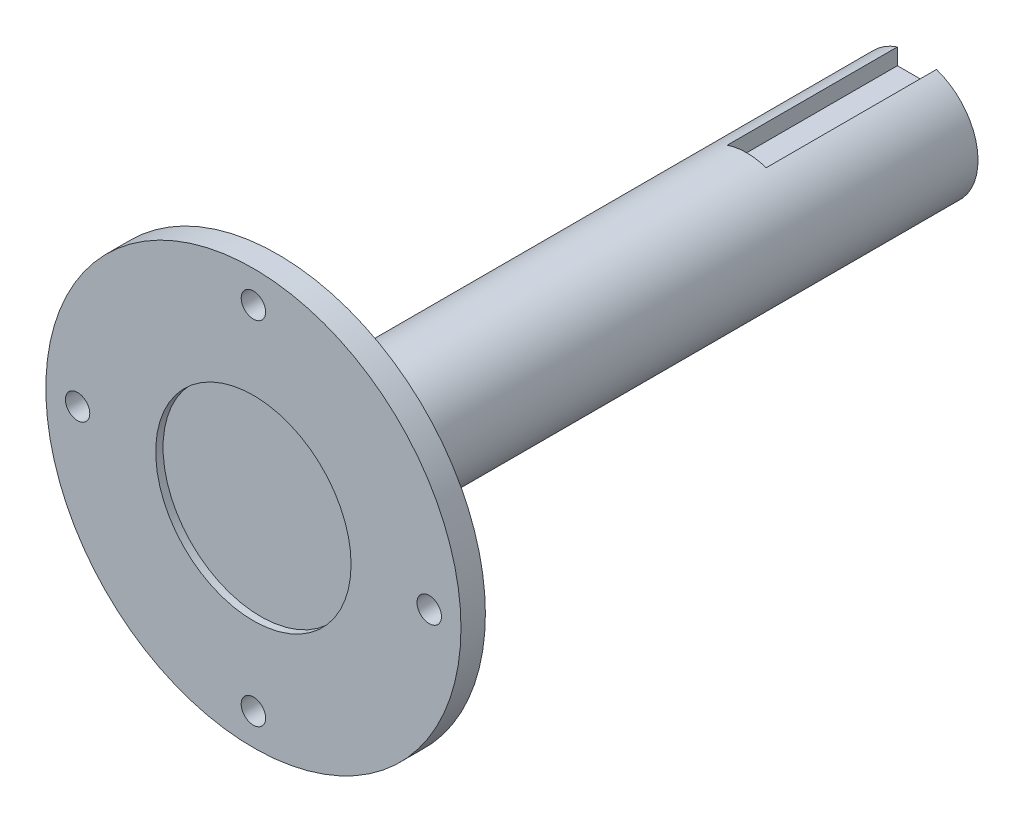
ISO-10303-21;
HEADER;
FILE_DESCRIPTION(('STEP AP214'),'2;1');
FILE_NAME('part.step','',(''),(''),'','','');
FILE_SCHEMA(('AUTOMOTIVE_DESIGN { 1 0 10303 214 1 1 1 1 }'));
ENDSEC;
DATA;
#1=APPLICATION_CONTEXT('core data for automotive mechanical design processes');
#2=APPLICATION_PROTOCOL_DEFINITION('international standard','automotive_design',2000,#1);
#3=PRODUCT_CONTEXT('',#1,'mechanical');
#4=PRODUCT('Part','Part','',(#3));
#5=PRODUCT_RELATED_PRODUCT_CATEGORY('part','',(#4));
#6=PRODUCT_DEFINITION_FORMATION('','',#4);
#7=PRODUCT_DEFINITION_CONTEXT('part definition',#1,'design');
#8=PRODUCT_DEFINITION('design','',#6,#7);
#9=PRODUCT_DEFINITION_SHAPE('','',#8);
#10=(LENGTH_UNIT() NAMED_UNIT(*) SI_UNIT(.MILLI.,.METRE.));
#11=(NAMED_UNIT(*) PLANE_ANGLE_UNIT() SI_UNIT($,.RADIAN.));
#12=(NAMED_UNIT(*) SI_UNIT($,.STERADIAN.) SOLID_ANGLE_UNIT());
#13=UNCERTAINTY_MEASURE_WITH_UNIT(LENGTH_MEASURE(1.E-05),#10,'distance_accuracy_value','');
#14=(GEOMETRIC_REPRESENTATION_CONTEXT(3) GLOBAL_UNCERTAINTY_ASSIGNED_CONTEXT((#13)) GLOBAL_UNIT_ASSIGNED_CONTEXT((#10,
#11,#12)) REPRESENTATION_CONTEXT('',''));
#15=CARTESIAN_POINT('',(0.,0.,0.));
#16=DIRECTION('',(0.,0.,1.));
#17=DIRECTION('',(1.,0.,0.));
#18=AXIS2_PLACEMENT_3D('',#15,#16,#17);
#19=CARTESIAN_POINT('',(0.,0.,119.4));
#20=DIRECTION('',(0.,0.,-1.));
#21=DIRECTION('',(-1.,0.,0.));
#22=AXIS2_PLACEMENT_3D('',#19,#20,#21);
#23=CYLINDRICAL_SURFACE('',#22,12.5);
#24=CARTESIAN_POINT('',(0.,0.,119.4));
#25=DIRECTION('',(0.,0.,1.));
#26=DIRECTION('',(1.,0.,0.));
#27=AXIS2_PLACEMENT_3D('',#24,#25,#26);
#28=CIRCLE('',#27,12.5);
#29=CARTESIAN_POINT('',(12.5,0.,119.4));
#30=VERTEX_POINT('',#29);
#31=EDGE_CURVE('E152',#30,#30,#28,.T.);
#32=ORIENTED_EDGE('',*,*,#31,.F.);
#33=EDGE_LOOP('',(#32));
#34=FACE_BOUND('',#33,.T.);
#35=CARTESIAN_POINT('',(0.,0.,0.53629326));
#36=DIRECTION('',(0.,0.,-1.));
#37=DIRECTION('',(-1.,0.,0.));
#38=AXIS2_PLACEMENT_3D('',#35,#36,#37);
#39=CIRCLE('',#38,12.5);
#40=CARTESIAN_POINT('',(4.,11.842719282327,0.53629326));
#41=VERTEX_POINT('',#40);
#42=CARTESIAN_POINT('',(-4.,11.842719282327,0.53629326));
#43=VERTEX_POINT('',#42);
#44=EDGE_CURVE('E100',#41,#43,#39,.T.);
#45=ORIENTED_EDGE('',*,*,#44,.F.);
#46=DIRECTION('',(0.,0.,-1.));
#47=VECTOR('',#46,1.);
#48=CARTESIAN_POINT('',(4.,11.842719282327,119.4));
#49=LINE('',#48,#47);
#50=CARTESIAN_POINT('',(4.,11.842719282327,35.4));
#51=VERTEX_POINT('',#50);
#52=EDGE_CURVE('E144',#41,#51,#49,.F.);
#53=ORIENTED_EDGE('',*,*,#52,.T.);
#54=CARTESIAN_POINT('',(0.,0.,35.4));
#55=DIRECTION('',(0.,0.,1.));
#56=DIRECTION('',(1.,0.,0.));
#57=AXIS2_PLACEMENT_3D('',#54,#55,#56);
#58=CIRCLE('',#57,12.5);
#59=CARTESIAN_POINT('',(-4.,11.842719282327,35.4));
#60=VERTEX_POINT('',#59);
#61=EDGE_CURVE('E121',#51,#60,#58,.T.);
#62=ORIENTED_EDGE('',*,*,#61,.T.);
#63=DIRECTION('',(0.,0.,-1.));
#64=VECTOR('',#63,1.);
#65=CARTESIAN_POINT('',(-4.,11.842719282327,119.4));
#66=LINE('',#65,#64);
#67=EDGE_CURVE('E68',#60,#43,#66,.T.);
#68=ORIENTED_EDGE('',*,*,#67,.T.);
#69=EDGE_LOOP('',(#45,#53,#62,#68));
#70=FACE_BOUND('',#69,.T.);
#71=ADVANCED_FACE('F45',(#34,#70),#23,.T.);
#72=CARTESIAN_POINT('',(-4.,8.5,35.4));
#73=DIRECTION('',(-1.,0.,0.));
#74=DIRECTION('',(0.,0.,1.));
#75=AXIS2_PLACEMENT_3D('',#72,#73,#74);
#76=PLANE('',#75);
#77=DIRECTION('',(0.,-1.,0.));
#78=VECTOR('',#77,1.);
#79=CARTESIAN_POINT('',(-4.,8.5,0.536293260000001));
#80=LINE('',#79,#78);
#81=CARTESIAN_POINT('',(-4.,8.5,0.536293260000001));
#82=VERTEX_POINT('',#81);
#83=EDGE_CURVE('E61',#43,#82,#80,.T.);
#84=ORIENTED_EDGE('',*,*,#83,.F.);
#85=ORIENTED_EDGE('',*,*,#67,.F.);
#86=DIRECTION('',(0.,1.,0.));
#87=VECTOR('',#86,1.);
#88=CARTESIAN_POINT('',(-4.,8.5,35.4));
#89=LINE('',#88,#87);
#90=CARTESIAN_POINT('',(-4.,8.5,35.4));
#91=VERTEX_POINT('',#90);
#92=EDGE_CURVE('E126',#91,#60,#89,.T.);
#93=ORIENTED_EDGE('',*,*,#92,.F.);
#94=DIRECTION('',(0.,0.,-1.));
#95=VECTOR('',#94,1.);
#96=CARTESIAN_POINT('',(-4.,8.5,35.4));
#97=LINE('',#96,#95);
#98=EDGE_CURVE('E140',#91,#82,#97,.T.);
#99=ORIENTED_EDGE('',*,*,#98,.T.);
#100=EDGE_LOOP('',(#84,#85,#93,#99));
#101=FACE_BOUND('',#100,.T.);
#102=ADVANCED_FACE('F173',(#101),#76,.F.);
#103=CARTESIAN_POINT('',(4.,8.5,35.4));
#104=DIRECTION('',(1.,0.,0.));
#105=DIRECTION('',(0.,0.,-1.));
#106=AXIS2_PLACEMENT_3D('',#103,#104,#105);
#107=PLANE('',#106);
#108=DIRECTION('',(0.,1.,0.));
#109=VECTOR('',#108,1.);
#110=CARTESIAN_POINT('',(4.,8.5,0.536293260000001));
#111=LINE('',#110,#109);
#112=CARTESIAN_POINT('',(4.,8.5,0.536293260000001));
#113=VERTEX_POINT('',#112);
#114=EDGE_CURVE('E105',#113,#41,#111,.T.);
#115=ORIENTED_EDGE('',*,*,#114,.F.);
#116=DIRECTION('',(0.,0.,-1.));
#117=VECTOR('',#116,1.);
#118=CARTESIAN_POINT('',(4.,8.5,35.4));
#119=LINE('',#118,#117);
#120=CARTESIAN_POINT('',(4.,8.5,35.4));
#121=VERTEX_POINT('',#120);
#122=EDGE_CURVE('E139',#121,#113,#119,.T.);
#123=ORIENTED_EDGE('',*,*,#122,.F.);
#124=DIRECTION('',(0.,-1.,0.));
#125=VECTOR('',#124,1.);
#126=CARTESIAN_POINT('',(4.,8.5,35.4));
#127=LINE('',#126,#125);
#128=EDGE_CURVE('E132',#51,#121,#127,.T.);
#129=ORIENTED_EDGE('',*,*,#128,.F.);
#130=ORIENTED_EDGE('',*,*,#52,.F.);
#131=EDGE_LOOP('',(#115,#123,#129,#130));
#132=FACE_BOUND('',#131,.T.);
#133=ADVANCED_FACE('F165',(#132),#107,.F.);
#134=CARTESIAN_POINT('',(4.,8.5,35.4));
#135=DIRECTION('',(0.,-1.,0.));
#136=DIRECTION('',(0.,0.,-1.));
#137=AXIS2_PLACEMENT_3D('',#134,#135,#136);
#138=PLANE('',#137);
#139=DIRECTION('',(1.,0.,0.));
#140=VECTOR('',#139,1.);
#141=CARTESIAN_POINT('',(4.,8.5,0.536293260000001));
#142=LINE('',#141,#140);
#143=EDGE_CURVE('E54',#82,#113,#142,.T.);
#144=ORIENTED_EDGE('',*,*,#143,.F.);
#145=ORIENTED_EDGE('',*,*,#98,.F.);
#146=DIRECTION('',(-1.,0.,0.));
#147=VECTOR('',#146,1.);
#148=CARTESIAN_POINT('',(4.,8.5,35.4));
#149=LINE('',#148,#147);
#150=EDGE_CURVE('E135',#121,#91,#149,.T.);
#151=ORIENTED_EDGE('',*,*,#150,.F.);
#152=ORIENTED_EDGE('',*,*,#122,.T.);
#153=EDGE_LOOP('',(#144,#145,#151,#152));
#154=FACE_BOUND('',#153,.T.);
#155=ADVANCED_FACE('F168',(#154),#138,.F.);
#156=CARTESIAN_POINT('',(0.,0.,35.4));
#157=DIRECTION('',(0.,0.,1.));
#158=DIRECTION('',(1.,0.,0.));
#159=AXIS2_PLACEMENT_3D('',#156,#157,#158);
#160=PLANE('',#159);
#161=ORIENTED_EDGE('',*,*,#128,.T.);
#162=ORIENTED_EDGE('',*,*,#150,.T.);
#163=ORIENTED_EDGE('',*,*,#92,.T.);
#164=ORIENTED_EDGE('',*,*,#61,.F.);
#165=EDGE_LOOP('',(#161,#162,#163,#164));
#166=FACE_BOUND('',#165,.T.);
#167=ADVANCED_FACE('F170',(#166),#160,.F.);
#168=CARTESIAN_POINT('',(0.,0.,121.4));
#169=DIRECTION('',(0.,0.,-1.));
#170=DIRECTION('',(-1.,0.,0.));
#171=AXIS2_PLACEMENT_3D('',#168,#169,#170);
#172=CYLINDRICAL_SURFACE('',#171,15.3);
#173=CARTESIAN_POINT('',(0.,0.,121.4));
#174=DIRECTION('',(0.,0.,1.));
#175=DIRECTION('',(1.,0.,0.));
#176=AXIS2_PLACEMENT_3D('',#173,#174,#175);
#177=CIRCLE('',#176,15.3);
#178=CARTESIAN_POINT('',(15.3,0.,121.4));
#179=VERTEX_POINT('',#178);
#180=EDGE_CURVE('E122',#179,#179,#177,.T.);
#181=ORIENTED_EDGE('',*,*,#180,.F.);
#182=EDGE_LOOP('',(#181));
#183=FACE_BOUND('',#182,.T.);
#184=CARTESIAN_POINT('',(0.,0.,119.4));
#185=DIRECTION('',(0.,0.,1.));
#186=DIRECTION('',(1.,0.,0.));
#187=AXIS2_PLACEMENT_3D('',#184,#185,#186);
#188=CIRCLE('',#187,15.3);
#189=CARTESIAN_POINT('',(15.3,0.,119.4));
#190=VERTEX_POINT('',#189);
#191=EDGE_CURVE('E116',#190,#190,#188,.T.);
#192=ORIENTED_EDGE('',*,*,#191,.T.);
#193=EDGE_LOOP('',(#192));
#194=FACE_BOUND('',#193,.T.);
#195=ADVANCED_FACE('F187',(#183,#194),#172,.T.);
#196=CARTESIAN_POINT('',(0.,0.,121.4));
#197=DIRECTION('',(0.,0.,1.));
#198=DIRECTION('',(1.,0.,0.));
#199=AXIS2_PLACEMENT_3D('',#196,#197,#198);
#200=PLANE('',#199);
#201=CARTESIAN_POINT('',(0.,0.,121.4));
#202=DIRECTION('',(0.,0.,1.));
#203=DIRECTION('',(1.,0.,0.));
#204=AXIS2_PLACEMENT_3D('',#201,#202,#203);
#205=CIRCLE('',#204,12.5);
#206=CARTESIAN_POINT('',(12.5,0.,121.4));
#207=VERTEX_POINT('',#206);
#208=EDGE_CURVE('E117',#207,#207,#205,.T.);
#209=ORIENTED_EDGE('',*,*,#208,.F.);
#210=EDGE_LOOP('',(#209));
#211=FACE_BOUND('',#210,.T.);
#212=ORIENTED_EDGE('',*,*,#180,.T.);
#213=EDGE_LOOP('',(#212));
#214=FACE_BOUND('',#213,.T.);
#215=ADVANCED_FACE('F190',(#211,#214),#200,.T.);
#216=CARTESIAN_POINT('',(0.,0.,119.4));
#217=DIRECTION('',(0.,0.,1.));
#218=DIRECTION('',(1.,0.,0.));
#219=AXIS2_PLACEMENT_3D('',#216,#217,#218);
#220=PLANE('',#219);
#221=ORIENTED_EDGE('',*,*,#31,.T.);
#222=EDGE_LOOP('',(#221));
#223=FACE_BOUND('',#222,.T.);
#224=ORIENTED_EDGE('',*,*,#191,.F.);
#225=EDGE_LOOP('',(#224));
#226=FACE_BOUND('',#225,.T.);
#227=ADVANCED_FACE('F192',(#223,#226),#220,.F.);
#228=CARTESIAN_POINT('',(0.,0.,0.53629326));
#229=DIRECTION('',(0.,0.,-1.));
#230=DIRECTION('',(-1.,0.,0.));
#231=AXIS2_PLACEMENT_3D('',#228,#229,#230);
#232=PLANE('',#231);
#233=CARTESIAN_POINT('',(0.,0.,0.536293259999999));
#234=DIRECTION('',(0.,0.,-1.));
#235=DIRECTION('',(-1.,0.,0.));
#236=AXIS2_PLACEMENT_3D('',#233,#234,#235);
#237=CIRCLE('',#236,2.49999999999999);
#238=CARTESIAN_POINT('',(-2.49999999999999,0.,0.536293259999999));
#239=VERTEX_POINT('',#238);
#240=EDGE_CURVE('E101',#239,#239,#237,.T.);
#241=ORIENTED_EDGE('',*,*,#240,.F.);
#242=EDGE_LOOP('',(#241));
#243=FACE_BOUND('',#242,.T.);
#244=ORIENTED_EDGE('',*,*,#83,.T.);
#245=ORIENTED_EDGE('',*,*,#143,.T.);
#246=ORIENTED_EDGE('',*,*,#114,.T.);
#247=ORIENTED_EDGE('',*,*,#44,.T.);
#248=EDGE_LOOP('',(#244,#245,#246,#247));
#249=FACE_BOUND('',#248,.T.);
#250=ADVANCED_FACE('F93',(#243,#249),#232,.T.);
#251=CARTESIAN_POINT('',(0.,0.,19.0341417124311));
#252=DIRECTION('',(0.,0.,-1.));
#253=DIRECTION('',(-1.,0.,0.));
#254=AXIS2_PLACEMENT_3D('',#251,#252,#253);
#255=CONICAL_SURFACE('',#254,2.5,1.02974425867665);
#256=CARTESIAN_POINT('',(0.,0.,20.53629326));
#257=VERTEX_POINT('',#256);
#258=VERTEX_LOOP('',#257);
#259=FACE_BOUND('',#258,.T.);
#260=CARTESIAN_POINT('',(0.,0.,19.0341417124311));
#261=DIRECTION('',(0.,0.,-1.));
#262=DIRECTION('',(-1.,0.,0.));
#263=AXIS2_PLACEMENT_3D('',#260,#261,#262);
#264=CIRCLE('',#263,2.5);
#265=CARTESIAN_POINT('',(-2.5,0.,19.0341417124311));
#266=VERTEX_POINT('',#265);
#267=EDGE_CURVE('E97',#266,#266,#264,.T.);
#268=ORIENTED_EDGE('',*,*,#267,.T.);
#269=EDGE_LOOP('',(#268));
#270=FACE_BOUND('',#269,.T.);
#271=ADVANCED_FACE('F89',(#259,#270),#255,.F.);
#272=CARTESIAN_POINT('',(0.,0.,0.53629326));
#273=DIRECTION('',(0.,0.,-1.));
#274=DIRECTION('',(-1.,0.,0.));
#275=AXIS2_PLACEMENT_3D('',#272,#273,#274);
#276=CYLINDRICAL_SURFACE('',#275,2.49999999999999);
#277=ORIENTED_EDGE('',*,*,#267,.F.);
#278=EDGE_LOOP('',(#277));
#279=FACE_BOUND('',#278,.T.);
#280=ORIENTED_EDGE('',*,*,#240,.T.);
#281=EDGE_LOOP('',(#280));
#282=FACE_BOUND('',#281,.T.);
#283=ADVANCED_FACE('F92',(#279,#282),#276,.F.);
#284=CARTESIAN_POINT('',(0.,0.,131.4));
#285=DIRECTION('',(0.,0.,1.));
#286=DIRECTION('',(1.,0.,0.));
#287=AXIS2_PLACEMENT_3D('',#284,#285,#286);
#288=CYLINDRICAL_SURFACE('',#287,42.5);
#289=CARTESIAN_POINT('',(0.,0.,131.4));
#290=DIRECTION('',(0.,0.,1.));
#291=DIRECTION('',(1.,0.,0.));
#292=AXIS2_PLACEMENT_3D('',#289,#290,#291);
#293=CIRCLE('',#292,42.5);
#294=CARTESIAN_POINT('',(42.5,0.,131.4));
#295=VERTEX_POINT('',#294);
#296=EDGE_CURVE('E108',#295,#295,#293,.T.);
#297=ORIENTED_EDGE('',*,*,#296,.T.);
#298=EDGE_LOOP('',(#297));
#299=FACE_BOUND('',#298,.T.);
#300=CARTESIAN_POINT('',(0.,0.,136.4));
#301=DIRECTION('',(0.,0.,1.));
#302=DIRECTION('',(1.,0.,0.));
#303=AXIS2_PLACEMENT_3D('',#300,#301,#302);
#304=CIRCLE('',#303,42.5);
#305=CARTESIAN_POINT('',(42.5,0.,136.4));
#306=VERTEX_POINT('',#305);
#307=EDGE_CURVE('E283',#306,#306,#304,.T.);
#308=ORIENTED_EDGE('',*,*,#307,.F.);
#309=EDGE_LOOP('',(#308));
#310=FACE_BOUND('',#309,.T.);
#311=ADVANCED_FACE('F209',(#299,#310),#288,.T.);
#312=CARTESIAN_POINT('',(0.,0.,131.4));
#313=DIRECTION('',(0.,0.,1.));
#314=DIRECTION('',(1.,0.,0.));
#315=AXIS2_PLACEMENT_3D('',#312,#313,#314);
#316=PLANE('',#315);
#317=CARTESIAN_POINT('',(0.,36.,131.4));
#318=DIRECTION('',(0.,0.,1.));
#319=DIRECTION('',(1.,0.,0.));
#320=AXIS2_PLACEMENT_3D('',#317,#318,#319);
#321=CIRCLE('',#320,2.49999999999999);
#322=CARTESIAN_POINT('',(2.49999999999999,36.,131.4));
#323=VERTEX_POINT('',#322);
#324=EDGE_CURVE('E251',#323,#323,#321,.T.);
#325=ORIENTED_EDGE('',*,*,#324,.T.);
#326=EDGE_LOOP('',(#325));
#327=FACE_BOUND('',#326,.T.);
#328=CARTESIAN_POINT('',(36.,0.,131.4));
#329=DIRECTION('',(0.,0.,1.));
#330=DIRECTION('',(1.,0.,0.));
#331=AXIS2_PLACEMENT_3D('',#328,#329,#330);
#332=CIRCLE('',#331,2.5);
#333=CARTESIAN_POINT('',(38.5,0.,131.4));
#334=VERTEX_POINT('',#333);
#335=EDGE_CURVE('E263',#334,#334,#332,.T.);
#336=ORIENTED_EDGE('',*,*,#335,.T.);
#337=EDGE_LOOP('',(#336));
#338=FACE_BOUND('',#337,.T.);
#339=CARTESIAN_POINT('',(0.,-36.,131.4));
#340=DIRECTION('',(0.,0.,1.));
#341=DIRECTION('',(1.,0.,0.));
#342=AXIS2_PLACEMENT_3D('',#339,#340,#341);
#343=CIRCLE('',#342,2.49999999999999);
#344=CARTESIAN_POINT('',(2.49999999999999,-36.,131.4));
#345=VERTEX_POINT('',#344);
#346=EDGE_CURVE('E271',#345,#345,#343,.T.);
#347=ORIENTED_EDGE('',*,*,#346,.T.);
#348=EDGE_LOOP('',(#347));
#349=FACE_BOUND('',#348,.T.);
#350=CARTESIAN_POINT('',(-36.,0.,131.4));
#351=DIRECTION('',(0.,0.,1.));
#352=DIRECTION('',(1.,0.,0.));
#353=AXIS2_PLACEMENT_3D('',#350,#351,#352);
#354=CIRCLE('',#353,2.5);
#355=CARTESIAN_POINT('',(-33.5,0.,131.4));
#356=VERTEX_POINT('',#355);
#357=EDGE_CURVE('E279',#356,#356,#354,.T.);
#358=ORIENTED_EDGE('',*,*,#357,.T.);
#359=EDGE_LOOP('',(#358));
#360=FACE_BOUND('',#359,.T.);
#361=CARTESIAN_POINT('',(0.,0.,131.4));
#362=DIRECTION('',(0.,0.,1.));
#363=DIRECTION('',(1.,0.,0.));
#364=AXIS2_PLACEMENT_3D('',#361,#362,#363);
#365=CIRCLE('',#364,22.5);
#366=CARTESIAN_POINT('',(22.5,0.,131.4));
#367=VERTEX_POINT('',#366);
#368=EDGE_CURVE('E11',#367,#367,#365,.T.);
#369=ORIENTED_EDGE('',*,*,#368,.T.);
#370=EDGE_LOOP('',(#369));
#371=FACE_BOUND('',#370,.T.);
#372=ORIENTED_EDGE('',*,*,#296,.F.);
#373=EDGE_LOOP('',(#372));
#374=FACE_BOUND('',#373,.T.);
#375=ADVANCED_FACE('F202',(#327,#338,#349,#360,#371,#374),#316,.F.);
#376=CARTESIAN_POINT('',(0.,0.,136.4));
#377=DIRECTION('',(0.,0.,1.));
#378=DIRECTION('',(1.,0.,0.));
#379=AXIS2_PLACEMENT_3D('',#376,#377,#378);
#380=PLANE('',#379);
#381=CARTESIAN_POINT('',(0.,0.,136.4));
#382=DIRECTION('',(0.,0.,1.));
#383=DIRECTION('',(1.,0.,0.));
#384=AXIS2_PLACEMENT_3D('',#381,#382,#383);
#385=CIRCLE('',#384,20.);
#386=CARTESIAN_POINT('',(20.,0.,136.4));
#387=VERTEX_POINT('',#386);
#388=EDGE_CURVE('E246',#387,#387,#385,.T.);
#389=ORIENTED_EDGE('',*,*,#388,.F.);
#390=EDGE_LOOP('',(#389));
#391=FACE_BOUND('',#390,.T.);
#392=CARTESIAN_POINT('',(0.,36.,136.4));
#393=DIRECTION('',(0.,0.,1.));
#394=DIRECTION('',(1.,0.,0.));
#395=AXIS2_PLACEMENT_3D('',#392,#393,#394);
#396=CIRCLE('',#395,2.49999999999999);
#397=CARTESIAN_POINT('',(2.49999999999999,36.,136.4));
#398=VERTEX_POINT('',#397);
#399=EDGE_CURVE('E245',#398,#398,#396,.T.);
#400=ORIENTED_EDGE('',*,*,#399,.F.);
#401=EDGE_LOOP('',(#400));
#402=FACE_BOUND('',#401,.T.);
#403=CARTESIAN_POINT('',(36.,0.,136.4));
#404=DIRECTION('',(0.,0.,1.));
#405=DIRECTION('',(1.,0.,0.));
#406=AXIS2_PLACEMENT_3D('',#403,#404,#405);
#407=CIRCLE('',#406,2.49999999999999);
#408=CARTESIAN_POINT('',(38.5,0.,136.4));
#409=VERTEX_POINT('',#408);
#410=EDGE_CURVE('E259',#409,#409,#407,.T.);
#411=ORIENTED_EDGE('',*,*,#410,.F.);
#412=EDGE_LOOP('',(#411));
#413=FACE_BOUND('',#412,.T.);
#414=CARTESIAN_POINT('',(0.,-36.,136.4));
#415=DIRECTION('',(0.,0.,1.));
#416=DIRECTION('',(1.,0.,0.));
#417=AXIS2_PLACEMENT_3D('',#414,#415,#416);
#418=CIRCLE('',#417,2.49999999999999);
#419=CARTESIAN_POINT('',(2.49999999999999,-36.,136.4));
#420=VERTEX_POINT('',#419);
#421=EDGE_CURVE('E267',#420,#420,#418,.T.);
#422=ORIENTED_EDGE('',*,*,#421,.F.);
#423=EDGE_LOOP('',(#422));
#424=FACE_BOUND('',#423,.T.);
#425=CARTESIAN_POINT('',(-36.,0.,136.4));
#426=DIRECTION('',(0.,0.,1.));
#427=DIRECTION('',(1.,0.,0.));
#428=AXIS2_PLACEMENT_3D('',#425,#426,#427);
#429=CIRCLE('',#428,2.49999999999999);
#430=CARTESIAN_POINT('',(-33.5,0.,136.4));
#431=VERTEX_POINT('',#430);
#432=EDGE_CURVE('E275',#431,#431,#429,.T.);
#433=ORIENTED_EDGE('',*,*,#432,.F.);
#434=EDGE_LOOP('',(#433));
#435=FACE_BOUND('',#434,.T.);
#436=ORIENTED_EDGE('',*,*,#307,.T.);
#437=EDGE_LOOP('',(#436));
#438=FACE_BOUND('',#437,.T.);
#439=ADVANCED_FACE('F199',(#391,#402,#413,#424,#435,#438),#380,.T.);
#440=CARTESIAN_POINT('',(0.,0.,121.4));
#441=DIRECTION('',(0.,0.,1.));
#442=DIRECTION('',(1.,0.,0.));
#443=AXIS2_PLACEMENT_3D('',#440,#441,#442);
#444=TOROIDAL_SURFACE('',#443,22.5,10.);
#445=ORIENTED_EDGE('',*,*,#208,.T.);
#446=EDGE_LOOP('',(#445));
#447=FACE_BOUND('',#446,.T.);
#448=ORIENTED_EDGE('',*,*,#368,.F.);
#449=EDGE_LOOP('',(#448));
#450=FACE_BOUND('',#449,.T.);
#451=ADVANCED_FACE('F47',(#447,#450),#444,.F.);
#452=CARTESIAN_POINT('',(-36.,0.,136.4));
#453=DIRECTION('',(0.,0.,1.));
#454=DIRECTION('',(1.,0.,0.));
#455=AXIS2_PLACEMENT_3D('',#452,#453,#454);
#456=CYLINDRICAL_SURFACE('',#455,2.5);
#457=ORIENTED_EDGE('',*,*,#357,.F.);
#458=EDGE_LOOP('',(#457));
#459=FACE_BOUND('',#458,.T.);
#460=ORIENTED_EDGE('',*,*,#432,.T.);
#461=EDGE_LOOP('',(#460));
#462=FACE_BOUND('',#461,.T.);
#463=ADVANCED_FACE('F216',(#459,#462),#456,.F.);
#464=CARTESIAN_POINT('',(0.,-36.,136.4));
#465=DIRECTION('',(0.,0.,1.));
#466=DIRECTION('',(1.,0.,0.));
#467=AXIS2_PLACEMENT_3D('',#464,#465,#466);
#468=CYLINDRICAL_SURFACE('',#467,2.49999999999999);
#469=ORIENTED_EDGE('',*,*,#346,.F.);
#470=EDGE_LOOP('',(#469));
#471=FACE_BOUND('',#470,.T.);
#472=ORIENTED_EDGE('',*,*,#421,.T.);
#473=EDGE_LOOP('',(#472));
#474=FACE_BOUND('',#473,.T.);
#475=ADVANCED_FACE('F219',(#471,#474),#468,.F.);
#476=CARTESIAN_POINT('',(36.,0.,136.4));
#477=DIRECTION('',(0.,0.,1.));
#478=DIRECTION('',(1.,0.,0.));
#479=AXIS2_PLACEMENT_3D('',#476,#477,#478);
#480=CYLINDRICAL_SURFACE('',#479,2.5);
#481=ORIENTED_EDGE('',*,*,#335,.F.);
#482=EDGE_LOOP('',(#481));
#483=FACE_BOUND('',#482,.T.);
#484=ORIENTED_EDGE('',*,*,#410,.T.);
#485=EDGE_LOOP('',(#484));
#486=FACE_BOUND('',#485,.T.);
#487=ADVANCED_FACE('F223',(#483,#486),#480,.F.);
#488=CARTESIAN_POINT('',(0.,36.,136.4));
#489=DIRECTION('',(0.,0.,1.));
#490=DIRECTION('',(1.,0.,0.));
#491=AXIS2_PLACEMENT_3D('',#488,#489,#490);
#492=CYLINDRICAL_SURFACE('',#491,2.49999999999999);
#493=ORIENTED_EDGE('',*,*,#324,.F.);
#494=EDGE_LOOP('',(#493));
#495=FACE_BOUND('',#494,.T.);
#496=ORIENTED_EDGE('',*,*,#399,.T.);
#497=EDGE_LOOP('',(#496));
#498=FACE_BOUND('',#497,.T.);
#499=ADVANCED_FACE('F227',(#495,#498),#492,.F.);
#500=CARTESIAN_POINT('',(0.,0.,134.9));
#501=DIRECTION('',(0.,0.,1.));
#502=DIRECTION('',(1.,0.,0.));
#503=AXIS2_PLACEMENT_3D('',#500,#501,#502);
#504=CYLINDRICAL_SURFACE('',#503,20.);
#505=CARTESIAN_POINT('',(0.,0.,134.9));
#506=DIRECTION('',(0.,0.,1.));
#507=DIRECTION('',(1.,0.,0.));
#508=AXIS2_PLACEMENT_3D('',#505,#506,#507);
#509=CIRCLE('',#508,20.);
#510=CARTESIAN_POINT('',(20.,0.,134.9));
#511=VERTEX_POINT('',#510);
#512=EDGE_CURVE('E243',#511,#511,#509,.T.);
#513=ORIENTED_EDGE('',*,*,#512,.F.);
#514=EDGE_LOOP('',(#513));
#515=FACE_BOUND('',#514,.T.);
#516=ORIENTED_EDGE('',*,*,#388,.T.);
#517=EDGE_LOOP('',(#516));
#518=FACE_BOUND('',#517,.T.);
#519=ADVANCED_FACE('F231',(#515,#518),#504,.F.);
#520=CARTESIAN_POINT('',(0.,0.,134.9));
#521=DIRECTION('',(0.,0.,1.));
#522=DIRECTION('',(1.,0.,0.));
#523=AXIS2_PLACEMENT_3D('',#520,#521,#522);
#524=PLANE('',#523);
#525=ORIENTED_EDGE('',*,*,#512,.T.);
#526=EDGE_LOOP('',(#525));
#527=FACE_BOUND('',#526,.T.);
#528=ADVANCED_FACE('F235',(#527),#524,.T.);
#529=CLOSED_SHELL('',(#71,#102,#133,#155,#167,#195,#215,#227,#250,#271,#283,#311,#375,#439,#451,
#463,#475,#487,#499,#519,#528));
#530=MANIFOLD_SOLID_BREP('B2',#529);
#531=ADVANCED_BREP_SHAPE_REPRESENTATION('',(#18,#530),#14);
#532=SHAPE_DEFINITION_REPRESENTATION(#9,#531);
ENDSEC;
END-ISO-10303-21;
